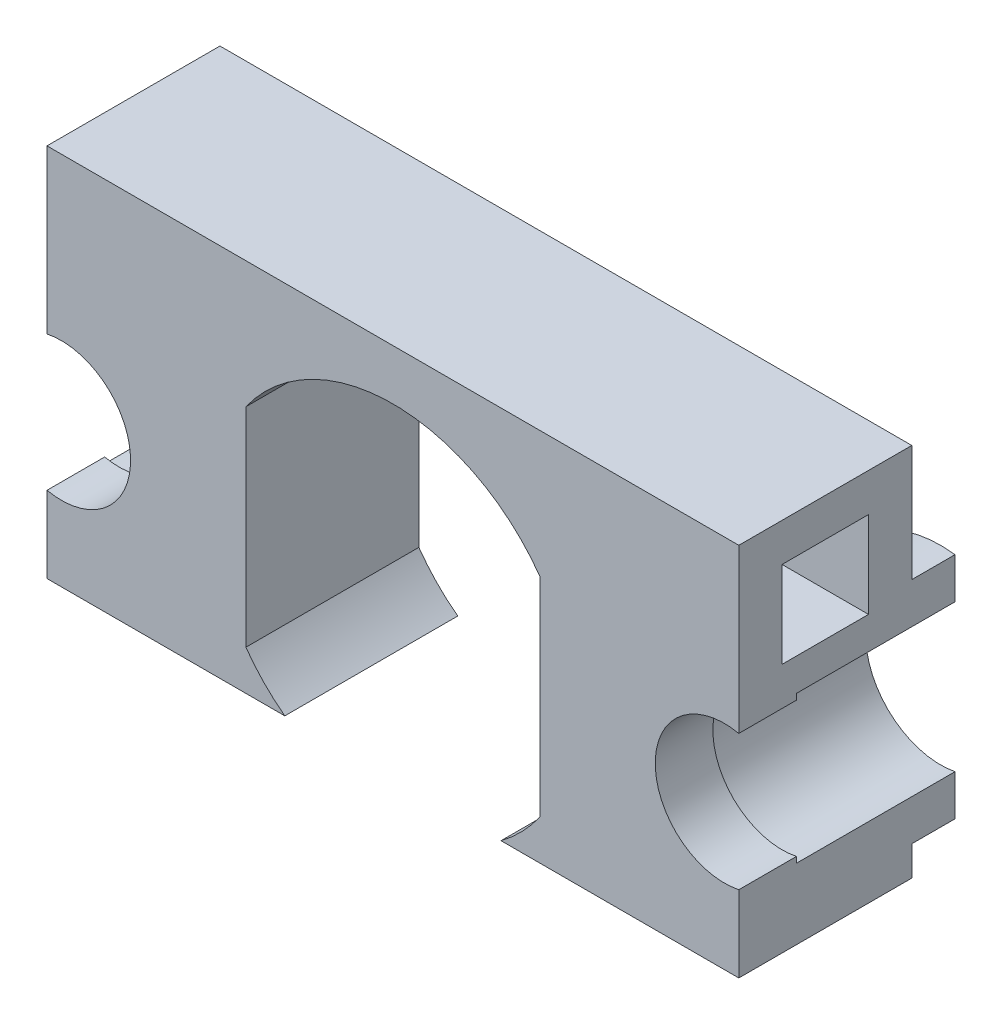
ISO-10303-21;
HEADER;
FILE_DESCRIPTION(('STEP AP214'),'2;1');
FILE_NAME('part.step','',(''),(''),'','','');
FILE_SCHEMA(('AUTOMOTIVE_DESIGN { 1 0 10303 214 1 1 1 1 }'));
ENDSEC;
DATA;
#1=APPLICATION_CONTEXT('core data for automotive mechanical design processes');
#2=APPLICATION_PROTOCOL_DEFINITION('international standard','automotive_design',2000,#1);
#3=PRODUCT_CONTEXT('',#1,'mechanical');
#4=PRODUCT('Part','Part','',(#3));
#5=PRODUCT_RELATED_PRODUCT_CATEGORY('part','',(#4));
#6=PRODUCT_DEFINITION_FORMATION('','',#4);
#7=PRODUCT_DEFINITION_CONTEXT('part definition',#1,'design');
#8=PRODUCT_DEFINITION('design','',#6,#7);
#9=PRODUCT_DEFINITION_SHAPE('','',#8);
#10=(LENGTH_UNIT() NAMED_UNIT(*) SI_UNIT(.MILLI.,.METRE.));
#11=(NAMED_UNIT(*) PLANE_ANGLE_UNIT() SI_UNIT($,.RADIAN.));
#12=(NAMED_UNIT(*) SI_UNIT($,.STERADIAN.) SOLID_ANGLE_UNIT());
#13=UNCERTAINTY_MEASURE_WITH_UNIT(LENGTH_MEASURE(1.E-05),#10,'distance_accuracy_value','');
#14=(GEOMETRIC_REPRESENTATION_CONTEXT(3) GLOBAL_UNCERTAINTY_ASSIGNED_CONTEXT((#13)) GLOBAL_UNIT_ASSIGNED_CONTEXT((#10,
#11,#12)) REPRESENTATION_CONTEXT('',''));
#15=CARTESIAN_POINT('',(0.,0.,0.));
#16=DIRECTION('',(0.,0.,1.));
#17=DIRECTION('',(1.,0.,0.));
#18=AXIS2_PLACEMENT_3D('',#15,#16,#17);
#19=CARTESIAN_POINT('',(-12.,-5.,-7.5));
#20=DIRECTION('',(1.,0.,0.));
#21=DIRECTION('',(0.,0.,-1.));
#22=AXIS2_PLACEMENT_3D('',#19,#20,#21);
#23=PLANE('',#22);
#24=DIRECTION('',(0.,0.,1.));
#25=VECTOR('',#24,1.);
#26=CARTESIAN_POINT('',(-12.,3.96862696659689,-1.5));
#27=LINE('',#26,#25);
#28=CARTESIAN_POINT('',(-12.,3.96862696659689,0.));
#29=VERTEX_POINT('',#28);
#30=CARTESIAN_POINT('',(-12.,3.96862696659689,-1.5));
#31=VERTEX_POINT('',#30);
#32=EDGE_CURVE('E450',#29,#31,#27,.F.);
#33=ORIENTED_EDGE('',*,*,#32,.T.);
#34=DIRECTION('',(0.,1.,0.));
#35=VECTOR('',#34,1.);
#36=CARTESIAN_POINT('',(-12.,0.,-1.5));
#37=LINE('',#36,#35);
#38=CARTESIAN_POINT('',(-12.,2.55147016443461,-1.5));
#39=VERTEX_POINT('',#38);
#40=EDGE_CURVE('E432',#39,#31,#37,.T.);
#41=ORIENTED_EDGE('',*,*,#40,.F.);
#42=DIRECTION('',(0.,0.,-1.));
#43=VECTOR('',#42,1.);
#44=CARTESIAN_POINT('',(-12.,2.55147016443461,6.));
#45=LINE('',#44,#43);
#46=CARTESIAN_POINT('',(-12.,2.55147016443461,4.));
#47=VERTEX_POINT('',#46);
#48=EDGE_CURVE('E56',#39,#47,#45,.F.);
#49=ORIENTED_EDGE('',*,*,#48,.T.);
#50=DIRECTION('',(0.,1.,0.));
#51=VECTOR('',#50,1.);
#52=CARTESIAN_POINT('',(-12.,0.,4.));
#53=LINE('',#52,#51);
#54=CARTESIAN_POINT('',(-12.,2.3473389188611,4.));
#55=VERTEX_POINT('',#54);
#56=EDGE_CURVE('E449',#55,#47,#53,.T.);
#57=ORIENTED_EDGE('',*,*,#56,.F.);
#58=DIRECTION('',(0.,0.,1.));
#59=VECTOR('',#58,1.);
#60=CARTESIAN_POINT('',(-12.,2.3473389188611,4.));
#61=LINE('',#60,#59);
#62=CARTESIAN_POINT('',(-12.,2.3473389188611,6.));
#63=VERTEX_POINT('',#62);
#64=EDGE_CURVE('E339',#63,#55,#61,.F.);
#65=ORIENTED_EDGE('',*,*,#64,.F.);
#66=DIRECTION('',(0.,1.,0.));
#67=VECTOR('',#66,1.);
#68=CARTESIAN_POINT('',(-12.,0.,6.));
#69=LINE('',#68,#67);
#70=CARTESIAN_POINT('',(-12.,8.,6.));
#71=VERTEX_POINT('',#70);
#72=EDGE_CURVE('E12',#63,#71,#69,.T.);
#73=ORIENTED_EDGE('',*,*,#72,.T.);
#74=DIRECTION('',(0.,0.,1.));
#75=VECTOR('',#74,1.);
#76=CARTESIAN_POINT('',(-12.,8.,-7.5));
#77=LINE('',#76,#75);
#78=CARTESIAN_POINT('',(-12.,8.,0.));
#79=VERTEX_POINT('',#78);
#80=EDGE_CURVE('E513',#79,#71,#77,.T.);
#81=ORIENTED_EDGE('',*,*,#80,.F.);
#82=DIRECTION('',(0.,1.,0.));
#83=VECTOR('',#82,1.);
#84=CARTESIAN_POINT('',(-12.,0.,0.));
#85=LINE('',#84,#83);
#86=EDGE_CURVE('E426',#29,#79,#85,.T.);
#87=ORIENTED_EDGE('',*,*,#86,.F.);
#88=EDGE_LOOP('',(#33,#41,#49,#57,#65,#73,#81,#87));
#89=FACE_BOUND('',#88,.T.);
#90=DIRECTION('',(0.,-1.,0.));
#91=VECTOR('',#90,1.);
#92=CARTESIAN_POINT('',(-12.,3.67366945943055,4.5));
#93=LINE('',#92,#91);
#94=CARTESIAN_POINT('',(-12.,6.67366945943055,4.5));
#95=VERTEX_POINT('',#94);
#96=CARTESIAN_POINT('',(-12.,3.67366945943055,4.5));
#97=VERTEX_POINT('',#96);
#98=EDGE_CURVE('E65',#95,#97,#93,.T.);
#99=ORIENTED_EDGE('',*,*,#98,.T.);
#100=DIRECTION('',(0.,0.,-1.));
#101=VECTOR('',#100,1.);
#102=CARTESIAN_POINT('',(-12.,3.67366945943055,1.5));
#103=LINE('',#102,#101);
#104=CARTESIAN_POINT('',(-12.,3.67366945943055,1.5));
#105=VERTEX_POINT('',#104);
#106=EDGE_CURVE('E269',#97,#105,#103,.T.);
#107=ORIENTED_EDGE('',*,*,#106,.T.);
#108=DIRECTION('',(0.,1.,0.));
#109=VECTOR('',#108,1.);
#110=CARTESIAN_POINT('',(-12.,3.67366945943055,1.5));
#111=LINE('',#110,#109);
#112=CARTESIAN_POINT('',(-12.,6.67366945943055,1.5));
#113=VERTEX_POINT('',#112);
#114=EDGE_CURVE('E273',#105,#113,#111,.T.);
#115=ORIENTED_EDGE('',*,*,#114,.T.);
#116=DIRECTION('',(0.,0.,1.));
#117=VECTOR('',#116,1.);
#118=CARTESIAN_POINT('',(-12.,6.67366945943055,1.5));
#119=LINE('',#118,#117);
#120=EDGE_CURVE('E282',#113,#95,#119,.T.);
#121=ORIENTED_EDGE('',*,*,#120,.T.);
#122=EDGE_LOOP('',(#99,#107,#115,#121));
#123=FACE_BOUND('',#122,.T.);
#124=ADVANCED_FACE('F46',(#89,#123),#23,.F.);
#125=CARTESIAN_POINT('',(0.,0.,6.));
#126=DIRECTION('',(0.,0.,-1.));
#127=DIRECTION('',(-1.,0.,0.));
#128=AXIS2_PLACEMENT_3D('',#125,#126,#127);
#129=CYLINDRICAL_SURFACE('',#128,6.25);
#130=CARTESIAN_POINT('',(0.,0.,0.));
#131=DIRECTION('',(0.,0.,1.));
#132=DIRECTION('',(1.,0.,0.));
#133=AXIS2_PLACEMENT_3D('',#130,#131,#132);
#134=CIRCLE('',#133,6.25);
#135=CARTESIAN_POINT('',(-5.1,-3.61282437990003,0.));
#136=VERTEX_POINT('',#135);
#137=CARTESIAN_POINT('',(-3.75,-5.,0.));
#138=VERTEX_POINT('',#137);
#139=EDGE_CURVE('E394',#136,#138,#134,.T.);
#140=ORIENTED_EDGE('',*,*,#139,.F.);
#141=DIRECTION('',(0.,0.,-1.));
#142=VECTOR('',#141,1.);
#143=CARTESIAN_POINT('',(-5.1,-3.61282437990003,6.));
#144=LINE('',#143,#142);
#145=CARTESIAN_POINT('',(-5.1,-3.61282437990003,6.));
#146=VERTEX_POINT('',#145);
#147=EDGE_CURVE('E369',#146,#136,#144,.T.);
#148=ORIENTED_EDGE('',*,*,#147,.F.);
#149=CARTESIAN_POINT('',(0.,0.,6.));
#150=DIRECTION('',(0.,0.,1.));
#151=DIRECTION('',(1.,0.,0.));
#152=AXIS2_PLACEMENT_3D('',#149,#150,#151);
#153=CIRCLE('',#152,6.25);
#154=CARTESIAN_POINT('',(-3.75,-5.,6.));
#155=VERTEX_POINT('',#154);
#156=EDGE_CURVE('E330',#146,#155,#153,.T.);
#157=ORIENTED_EDGE('',*,*,#156,.T.);
#158=DIRECTION('',(0.,0.,-1.));
#159=VECTOR('',#158,1.);
#160=CARTESIAN_POINT('',(-3.75,-5.,6.));
#161=LINE('',#160,#159);
#162=EDGE_CURVE('E364',#155,#138,#161,.T.);
#163=ORIENTED_EDGE('',*,*,#162,.T.);
#164=EDGE_LOOP('',(#140,#148,#157,#163));
#165=FACE_BOUND('',#164,.T.);
#166=ADVANCED_FACE('F608',(#165),#129,.F.);
#167=CARTESIAN_POINT('',(-5.1,0.,6.));
#168=DIRECTION('',(-1.,0.,0.));
#169=DIRECTION('',(0.,-1.,0.));
#170=AXIS2_PLACEMENT_3D('',#167,#168,#169);
#171=PLANE('',#170);
#172=DIRECTION('',(0.,1.,0.));
#173=VECTOR('',#172,1.);
#174=CARTESIAN_POINT('',(-5.1,0.,0.));
#175=LINE('',#174,#173);
#176=CARTESIAN_POINT('',(-5.1,3.61282437990003,0.));
#177=VERTEX_POINT('',#176);
#178=EDGE_CURVE('E368',#136,#177,#175,.T.);
#179=ORIENTED_EDGE('',*,*,#178,.T.);
#180=DIRECTION('',(0.,0.,-1.));
#181=VECTOR('',#180,1.);
#182=CARTESIAN_POINT('',(-5.1,3.61282437990003,6.));
#183=LINE('',#182,#181);
#184=CARTESIAN_POINT('',(-5.1,3.61282437990003,6.));
#185=VERTEX_POINT('',#184);
#186=EDGE_CURVE('E373',#185,#177,#183,.T.);
#187=ORIENTED_EDGE('',*,*,#186,.F.);
#188=DIRECTION('',(0.,1.,0.));
#189=VECTOR('',#188,1.);
#190=CARTESIAN_POINT('',(-5.1,0.,6.));
#191=LINE('',#190,#189);
#192=EDGE_CURVE('E411',#146,#185,#191,.T.);
#193=ORIENTED_EDGE('',*,*,#192,.F.);
#194=ORIENTED_EDGE('',*,*,#147,.T.);
#195=EDGE_LOOP('',(#179,#187,#193,#194));
#196=FACE_BOUND('',#195,.T.);
#197=ADVANCED_FACE('F615',(#196),#171,.F.);
#198=CARTESIAN_POINT('',(0.,0.,6.));
#199=DIRECTION('',(0.,0.,-1.));
#200=DIRECTION('',(-1.,0.,0.));
#201=AXIS2_PLACEMENT_3D('',#198,#199,#200);
#202=CYLINDRICAL_SURFACE('',#201,6.25);
#203=CARTESIAN_POINT('',(0.,0.,0.));
#204=DIRECTION('',(0.,0.,1.));
#205=DIRECTION('',(1.,0.,0.));
#206=AXIS2_PLACEMENT_3D('',#203,#204,#205);
#207=CIRCLE('',#206,6.25);
#208=CARTESIAN_POINT('',(5.1,3.61282437990003,0.));
#209=VERTEX_POINT('',#208);
#210=EDGE_CURVE('E389',#209,#177,#207,.T.);
#211=ORIENTED_EDGE('',*,*,#210,.F.);
#212=DIRECTION('',(0.,0.,-1.));
#213=VECTOR('',#212,1.);
#214=CARTESIAN_POINT('',(5.1,3.61282437990003,6.));
#215=LINE('',#214,#213);
#216=CARTESIAN_POINT('',(5.1,3.61282437990003,6.));
#217=VERTEX_POINT('',#216);
#218=EDGE_CURVE('E377',#217,#209,#215,.T.);
#219=ORIENTED_EDGE('',*,*,#218,.F.);
#220=CARTESIAN_POINT('',(0.,0.,6.));
#221=DIRECTION('',(0.,0.,1.));
#222=DIRECTION('',(1.,0.,0.));
#223=AXIS2_PLACEMENT_3D('',#220,#221,#222);
#224=CIRCLE('',#223,6.25);
#225=EDGE_CURVE('E372',#217,#185,#224,.T.);
#226=ORIENTED_EDGE('',*,*,#225,.T.);
#227=ORIENTED_EDGE('',*,*,#186,.T.);
#228=EDGE_LOOP('',(#211,#219,#226,#227));
#229=FACE_BOUND('',#228,.T.);
#230=ADVANCED_FACE('F618',(#229),#202,.F.);
#231=CARTESIAN_POINT('',(5.1,0.,6.));
#232=DIRECTION('',(-1.,0.,0.));
#233=DIRECTION('',(0.,0.,1.));
#234=AXIS2_PLACEMENT_3D('',#231,#232,#233);
#235=PLANE('',#234);
#236=DIRECTION('',(0.,1.,0.));
#237=VECTOR('',#236,1.);
#238=CARTESIAN_POINT('',(5.1,0.,0.));
#239=LINE('',#238,#237);
#240=CARTESIAN_POINT('',(5.1,-3.61282437990002,0.));
#241=VERTEX_POINT('',#240);
#242=EDGE_CURVE('E385',#241,#209,#239,.T.);
#243=ORIENTED_EDGE('',*,*,#242,.F.);
#244=DIRECTION('',(0.,0.,-1.));
#245=VECTOR('',#244,1.);
#246=CARTESIAN_POINT('',(5.1,-3.61282437990002,6.));
#247=LINE('',#246,#245);
#248=CARTESIAN_POINT('',(5.1,-3.61282437990002,6.));
#249=VERTEX_POINT('',#248);
#250=EDGE_CURVE('E381',#249,#241,#247,.T.);
#251=ORIENTED_EDGE('',*,*,#250,.F.);
#252=DIRECTION('',(0.,1.,0.));
#253=VECTOR('',#252,1.);
#254=CARTESIAN_POINT('',(5.1,0.,6.));
#255=LINE('',#254,#253);
#256=EDGE_CURVE('E376',#249,#217,#255,.T.);
#257=ORIENTED_EDGE('',*,*,#256,.T.);
#258=ORIENTED_EDGE('',*,*,#218,.T.);
#259=EDGE_LOOP('',(#243,#251,#257,#258));
#260=FACE_BOUND('',#259,.T.);
#261=ADVANCED_FACE('F621',(#260),#235,.T.);
#262=CARTESIAN_POINT('',(0.,0.,6.));
#263=DIRECTION('',(0.,0.,-1.));
#264=DIRECTION('',(-1.,0.,0.));
#265=AXIS2_PLACEMENT_3D('',#262,#263,#264);
#266=CYLINDRICAL_SURFACE('',#265,6.25);
#267=CARTESIAN_POINT('',(0.,0.,0.));
#268=DIRECTION('',(0.,0.,1.));
#269=DIRECTION('',(1.,0.,0.));
#270=AXIS2_PLACEMENT_3D('',#267,#268,#269);
#271=CIRCLE('',#270,6.25);
#272=CARTESIAN_POINT('',(3.75,-5.,0.));
#273=VERTEX_POINT('',#272);
#274=EDGE_CURVE('E390',#273,#241,#271,.T.);
#275=ORIENTED_EDGE('',*,*,#274,.F.);
#276=DIRECTION('',(0.,0.,-1.));
#277=VECTOR('',#276,1.);
#278=CARTESIAN_POINT('',(3.75,-5.,6.));
#279=LINE('',#278,#277);
#280=CARTESIAN_POINT('',(3.75,-5.,6.));
#281=VERTEX_POINT('',#280);
#282=EDGE_CURVE('E359',#281,#273,#279,.T.);
#283=ORIENTED_EDGE('',*,*,#282,.F.);
#284=CARTESIAN_POINT('',(0.,0.,6.));
#285=DIRECTION('',(0.,0.,1.));
#286=DIRECTION('',(1.,0.,0.));
#287=AXIS2_PLACEMENT_3D('',#284,#285,#286);
#288=CIRCLE('',#287,6.25);
#289=EDGE_CURVE('E380',#281,#249,#288,.T.);
#290=ORIENTED_EDGE('',*,*,#289,.T.);
#291=ORIENTED_EDGE('',*,*,#250,.T.);
#292=EDGE_LOOP('',(#275,#283,#290,#291));
#293=FACE_BOUND('',#292,.T.);
#294=ADVANCED_FACE('F627',(#293),#266,.F.);
#295=CARTESIAN_POINT('',(11.5,0.,-1.5));
#296=DIRECTION('',(0.,0.,1.));
#297=DIRECTION('',(1.,0.,0.));
#298=AXIS2_PLACEMENT_3D('',#295,#296,#297);
#299=PLANE('',#298);
#300=CARTESIAN_POINT('',(11.5,0.,-1.5));
#301=DIRECTION('',(0.,0.,1.));
#302=DIRECTION('',(1.,0.,0.));
#303=AXIS2_PLACEMENT_3D('',#300,#301,#302);
#304=CIRCLE('',#303,4.);
#305=CARTESIAN_POINT('',(12.,3.96862696659689,-1.5));
#306=VERTEX_POINT('',#305);
#307=CARTESIAN_POINT('',(12.,-3.96862696659688,-1.5));
#308=VERTEX_POINT('',#307);
#309=EDGE_CURVE('E465',#306,#308,#304,.T.);
#310=ORIENTED_EDGE('',*,*,#309,.F.);
#311=DIRECTION('',(0.,-1.,0.));
#312=VECTOR('',#311,1.);
#313=CARTESIAN_POINT('',(12.,0.,-1.5));
#314=LINE('',#313,#312);
#315=CARTESIAN_POINT('',(12.,2.55147016443462,-1.5));
#316=VERTEX_POINT('',#315);
#317=EDGE_CURVE('E384',#306,#316,#314,.T.);
#318=ORIENTED_EDGE('',*,*,#317,.T.);
#319=CARTESIAN_POINT('',(11.5,0.,-1.5));
#320=DIRECTION('',(0.,0.,1.));
#321=DIRECTION('',(1.,0.,0.));
#322=AXIS2_PLACEMENT_3D('',#319,#320,#321);
#323=CIRCLE('',#322,2.6);
#324=CARTESIAN_POINT('',(12.,-2.55147016443461,-1.5));
#325=VERTEX_POINT('',#324);
#326=EDGE_CURVE('E492',#316,#325,#323,.T.);
#327=ORIENTED_EDGE('',*,*,#326,.T.);
#328=EDGE_CURVE('E493',#325,#308,#314,.T.);
#329=ORIENTED_EDGE('',*,*,#328,.T.);
#330=EDGE_LOOP('',(#310,#318,#327,#329));
#331=FACE_BOUND('',#330,.T.);
#332=ADVANCED_FACE('F569',(#331),#299,.F.);
#333=CARTESIAN_POINT('',(11.5,0.,-1.5));
#334=DIRECTION('',(0.,0.,1.));
#335=DIRECTION('',(1.,0.,0.));
#336=AXIS2_PLACEMENT_3D('',#333,#334,#335);
#337=CYLINDRICAL_SURFACE('',#336,4.);
#338=DIRECTION('',(0.,0.,1.));
#339=VECTOR('',#338,1.);
#340=CARTESIAN_POINT('',(12.,-3.96862696659688,-1.5));
#341=LINE('',#340,#339);
#342=CARTESIAN_POINT('',(12.,-3.96862696659688,0.));
#343=VERTEX_POINT('',#342);
#344=EDGE_CURVE('E473',#343,#308,#341,.F.);
#345=ORIENTED_EDGE('',*,*,#344,.F.);
#346=CARTESIAN_POINT('',(11.5,0.,0.));
#347=DIRECTION('',(0.,0.,1.));
#348=DIRECTION('',(1.,0.,0.));
#349=AXIS2_PLACEMENT_3D('',#346,#347,#348);
#350=CIRCLE('',#349,4.);
#351=CARTESIAN_POINT('',(12.,3.96862696659689,0.));
#352=VERTEX_POINT('',#351);
#353=EDGE_CURVE('E485',#352,#343,#350,.T.);
#354=ORIENTED_EDGE('',*,*,#353,.F.);
#355=DIRECTION('',(0.,0.,1.));
#356=VECTOR('',#355,1.);
#357=CARTESIAN_POINT('',(12.,3.96862696659689,-1.5));
#358=LINE('',#357,#356);
#359=EDGE_CURVE('E477',#306,#352,#358,.T.);
#360=ORIENTED_EDGE('',*,*,#359,.F.);
#361=ORIENTED_EDGE('',*,*,#309,.T.);
#362=EDGE_LOOP('',(#345,#354,#360,#361));
#363=FACE_BOUND('',#362,.T.);
#364=ADVANCED_FACE('F573',(#363),#337,.T.);
#365=CARTESIAN_POINT('',(-11.5,0.,-1.5));
#366=DIRECTION('',(0.,0.,1.));
#367=DIRECTION('',(1.,0.,0.));
#368=AXIS2_PLACEMENT_3D('',#365,#366,#367);
#369=PLANE('',#368);
#370=CARTESIAN_POINT('',(-11.5,0.,-1.5));
#371=DIRECTION('',(0.,0.,1.));
#372=DIRECTION('',(1.,0.,0.));
#373=AXIS2_PLACEMENT_3D('',#370,#371,#372);
#374=CIRCLE('',#373,4.);
#375=CARTESIAN_POINT('',(-12.,-3.96862696659689,-1.5));
#376=VERTEX_POINT('',#375);
#377=EDGE_CURVE('E428',#376,#31,#374,.T.);
#378=ORIENTED_EDGE('',*,*,#377,.F.);
#379=CARTESIAN_POINT('',(-12.,-2.55147016443461,-1.5));
#380=VERTEX_POINT('',#379);
#381=EDGE_CURVE('E437',#376,#380,#37,.T.);
#382=ORIENTED_EDGE('',*,*,#381,.T.);
#383=CARTESIAN_POINT('',(-11.5,0.,-1.5));
#384=DIRECTION('',(0.,0.,1.));
#385=DIRECTION('',(1.,0.,0.));
#386=AXIS2_PLACEMENT_3D('',#383,#384,#385);
#387=CIRCLE('',#386,2.6);
#388=EDGE_CURVE('E433',#380,#39,#387,.T.);
#389=ORIENTED_EDGE('',*,*,#388,.T.);
#390=ORIENTED_EDGE('',*,*,#40,.T.);
#391=EDGE_LOOP('',(#378,#382,#389,#390));
#392=FACE_BOUND('',#391,.T.);
#393=ADVANCED_FACE('F591',(#392),#369,.F.);
#394=CARTESIAN_POINT('',(-11.5,0.,-1.5));
#395=DIRECTION('',(0.,0.,1.));
#396=DIRECTION('',(1.,0.,0.));
#397=AXIS2_PLACEMENT_3D('',#394,#395,#396);
#398=CYLINDRICAL_SURFACE('',#397,4.);
#399=ORIENTED_EDGE('',*,*,#32,.F.);
#400=CARTESIAN_POINT('',(-11.5,0.,0.));
#401=DIRECTION('',(0.,0.,1.));
#402=DIRECTION('',(1.,0.,0.));
#403=AXIS2_PLACEMENT_3D('',#400,#401,#402);
#404=CIRCLE('',#403,4.);
#405=CARTESIAN_POINT('',(-12.,-3.96862696659689,0.));
#406=VERTEX_POINT('',#405);
#407=EDGE_CURVE('E422',#406,#29,#404,.T.);
#408=ORIENTED_EDGE('',*,*,#407,.F.);
#409=DIRECTION('',(0.,0.,1.));
#410=VECTOR('',#409,1.);
#411=CARTESIAN_POINT('',(-12.,-3.96862696659689,-1.5));
#412=LINE('',#411,#410);
#413=EDGE_CURVE('E453',#376,#406,#412,.T.);
#414=ORIENTED_EDGE('',*,*,#413,.F.);
#415=ORIENTED_EDGE('',*,*,#377,.T.);
#416=EDGE_LOOP('',(#399,#408,#414,#415));
#417=FACE_BOUND('',#416,.T.);
#418=ADVANCED_FACE('F598',(#417),#398,.T.);
#419=CARTESIAN_POINT('',(0.,0.,0.));
#420=DIRECTION('',(0.,0.,1.));
#421=DIRECTION('',(1.,0.,0.));
#422=AXIS2_PLACEMENT_3D('',#419,#420,#421);
#423=PLANE('',#422);
#424=DIRECTION('',(1.,0.,0.));
#425=VECTOR('',#424,1.);
#426=CARTESIAN_POINT('',(0.,-5.,0.));
#427=LINE('',#426,#425);
#428=CARTESIAN_POINT('',(-12.,-5.,0.));
#429=VERTEX_POINT('',#428);
#430=EDGE_CURVE('E518',#429,#138,#427,.T.);
#431=ORIENTED_EDGE('',*,*,#430,.F.);
#432=EDGE_CURVE('E427',#429,#406,#85,.T.);
#433=ORIENTED_EDGE('',*,*,#432,.T.);
#434=ORIENTED_EDGE('',*,*,#407,.T.);
#435=ORIENTED_EDGE('',*,*,#86,.T.);
#436=DIRECTION('',(1.,0.,0.));
#437=VECTOR('',#436,1.);
#438=CARTESIAN_POINT('',(0.,8.,0.));
#439=LINE('',#438,#437);
#440=CARTESIAN_POINT('',(12.,8.,0.));
#441=VERTEX_POINT('',#440);
#442=EDGE_CURVE('E50',#79,#441,#439,.T.);
#443=ORIENTED_EDGE('',*,*,#442,.T.);
#444=DIRECTION('',(0.,-1.,0.));
#445=VECTOR('',#444,1.);
#446=CARTESIAN_POINT('',(12.,0.,0.));
#447=LINE('',#446,#445);
#448=EDGE_CURVE('E481',#441,#352,#447,.T.);
#449=ORIENTED_EDGE('',*,*,#448,.T.);
#450=ORIENTED_EDGE('',*,*,#353,.T.);
#451=CARTESIAN_POINT('',(12.,-5.,0.));
#452=VERTEX_POINT('',#451);
#453=EDGE_CURVE('E404',#343,#452,#447,.T.);
#454=ORIENTED_EDGE('',*,*,#453,.T.);
#455=DIRECTION('',(1.,0.,0.));
#456=VECTOR('',#455,1.);
#457=CARTESIAN_POINT('',(0.,-5.,0.));
#458=LINE('',#457,#456);
#459=EDGE_CURVE('E510',#273,#452,#458,.T.);
#460=ORIENTED_EDGE('',*,*,#459,.F.);
#461=ORIENTED_EDGE('',*,*,#274,.T.);
#462=ORIENTED_EDGE('',*,*,#242,.T.);
#463=ORIENTED_EDGE('',*,*,#210,.T.);
#464=ORIENTED_EDGE('',*,*,#178,.F.);
#465=ORIENTED_EDGE('',*,*,#139,.T.);
#466=EDGE_LOOP('',(#431,#433,#434,#435,#443,#449,#450,#454,#460,#461,#462,#463,#464,#465));
#467=FACE_BOUND('',#466,.T.);
#468=ADVANCED_FACE('F579',(#467),#423,.F.);
#469=CARTESIAN_POINT('',(-11.5,0.,4.));
#470=DIRECTION('',(0.,0.,1.));
#471=DIRECTION('',(1.,0.,0.));
#472=AXIS2_PLACEMENT_3D('',#469,#470,#471);
#473=CYLINDRICAL_SURFACE('',#472,2.4);
#474=CARTESIAN_POINT('',(-11.5,0.,6.));
#475=DIRECTION('',(0.,0.,1.));
#476=DIRECTION('',(1.,0.,0.));
#477=AXIS2_PLACEMENT_3D('',#474,#475,#476);
#478=CIRCLE('',#477,2.4);
#479=CARTESIAN_POINT('',(-12.,-2.3473389188611,6.));
#480=VERTEX_POINT('',#479);
#481=EDGE_CURVE('E344',#480,#63,#478,.T.);
#482=ORIENTED_EDGE('',*,*,#481,.T.);
#483=ORIENTED_EDGE('',*,*,#64,.T.);
#484=CARTESIAN_POINT('',(-11.5,0.,4.));
#485=DIRECTION('',(0.,0.,1.));
#486=DIRECTION('',(1.,0.,0.));
#487=AXIS2_PLACEMENT_3D('',#484,#485,#486);
#488=CIRCLE('',#487,2.4);
#489=CARTESIAN_POINT('',(-12.,-2.3473389188611,4.));
#490=VERTEX_POINT('',#489);
#491=EDGE_CURVE('E445',#490,#55,#488,.T.);
#492=ORIENTED_EDGE('',*,*,#491,.F.);
#493=DIRECTION('',(0.,0.,1.));
#494=VECTOR('',#493,1.);
#495=CARTESIAN_POINT('',(-12.,-2.3473389188611,4.));
#496=LINE('',#495,#494);
#497=EDGE_CURVE('E343',#490,#480,#496,.T.);
#498=ORIENTED_EDGE('',*,*,#497,.T.);
#499=EDGE_LOOP('',(#482,#483,#492,#498));
#500=FACE_BOUND('',#499,.T.);
#501=ADVANCED_FACE('F643',(#500),#473,.F.);
#502=CARTESIAN_POINT('',(-11.5,0.,4.));
#503=DIRECTION('',(0.,0.,1.));
#504=DIRECTION('',(1.,0.,0.));
#505=AXIS2_PLACEMENT_3D('',#502,#503,#504);
#506=PLANE('',#505);
#507=CARTESIAN_POINT('',(-11.5,0.,4.));
#508=DIRECTION('',(0.,0.,1.));
#509=DIRECTION('',(1.,0.,0.));
#510=AXIS2_PLACEMENT_3D('',#507,#508,#509);
#511=CIRCLE('',#510,2.6);
#512=CARTESIAN_POINT('',(-12.,-2.55147016443461,4.));
#513=VERTEX_POINT('',#512);
#514=EDGE_CURVE('E362',#513,#47,#511,.T.);
#515=ORIENTED_EDGE('',*,*,#514,.F.);
#516=EDGE_CURVE('E348',#513,#490,#53,.T.);
#517=ORIENTED_EDGE('',*,*,#516,.T.);
#518=ORIENTED_EDGE('',*,*,#491,.T.);
#519=ORIENTED_EDGE('',*,*,#56,.T.);
#520=EDGE_LOOP('',(#515,#517,#518,#519));
#521=FACE_BOUND('',#520,.T.);
#522=ADVANCED_FACE('F637',(#521),#506,.F.);
#523=CARTESIAN_POINT('',(11.5,0.,4.));
#524=DIRECTION('',(0.,0.,1.));
#525=DIRECTION('',(1.,0.,0.));
#526=AXIS2_PLACEMENT_3D('',#523,#524,#525);
#527=CYLINDRICAL_SURFACE('',#526,2.4);
#528=CARTESIAN_POINT('',(11.5,0.,6.));
#529=DIRECTION('',(0.,0.,1.));
#530=DIRECTION('',(1.,0.,0.));
#531=AXIS2_PLACEMENT_3D('',#528,#529,#530);
#532=CIRCLE('',#531,2.4);
#533=CARTESIAN_POINT('',(12.,2.3473389188611,6.));
#534=VERTEX_POINT('',#533);
#535=CARTESIAN_POINT('',(12.,-2.34733891886109,6.));
#536=VERTEX_POINT('',#535);
#537=EDGE_CURVE('E354',#534,#536,#532,.T.);
#538=ORIENTED_EDGE('',*,*,#537,.T.);
#539=DIRECTION('',(0.,0.,1.));
#540=VECTOR('',#539,1.);
#541=CARTESIAN_POINT('',(12.,-2.34733891886109,4.));
#542=LINE('',#541,#540);
#543=CARTESIAN_POINT('',(12.,-2.34733891886109,4.));
#544=VERTEX_POINT('',#543);
#545=EDGE_CURVE('E349',#536,#544,#542,.F.);
#546=ORIENTED_EDGE('',*,*,#545,.T.);
#547=CARTESIAN_POINT('',(11.5,0.,4.));
#548=DIRECTION('',(0.,0.,1.));
#549=DIRECTION('',(1.,0.,0.));
#550=AXIS2_PLACEMENT_3D('',#547,#548,#549);
#551=CIRCLE('',#550,2.4);
#552=CARTESIAN_POINT('',(12.,2.3473389188611,4.));
#553=VERTEX_POINT('',#552);
#554=EDGE_CURVE('E503',#553,#544,#551,.T.);
#555=ORIENTED_EDGE('',*,*,#554,.F.);
#556=DIRECTION('',(0.,0.,1.));
#557=VECTOR('',#556,1.);
#558=CARTESIAN_POINT('',(12.,2.3473389188611,4.));
#559=LINE('',#558,#557);
#560=EDGE_CURVE('E353',#553,#534,#559,.T.);
#561=ORIENTED_EDGE('',*,*,#560,.T.);
#562=EDGE_LOOP('',(#538,#546,#555,#561));
#563=FACE_BOUND('',#562,.T.);
#564=ADVANCED_FACE('F652',(#563),#527,.F.);
#565=CARTESIAN_POINT('',(11.5,0.,4.));
#566=DIRECTION('',(0.,0.,1.));
#567=DIRECTION('',(1.,0.,0.));
#568=AXIS2_PLACEMENT_3D('',#565,#566,#567);
#569=PLANE('',#568);
#570=CARTESIAN_POINT('',(11.5,0.,4.));
#571=DIRECTION('',(0.,0.,1.));
#572=DIRECTION('',(1.,0.,0.));
#573=AXIS2_PLACEMENT_3D('',#570,#571,#572);
#574=CIRCLE('',#573,2.6);
#575=CARTESIAN_POINT('',(12.,2.55147016443462,4.));
#576=VERTEX_POINT('',#575);
#577=CARTESIAN_POINT('',(12.,-2.55147016443461,4.));
#578=VERTEX_POINT('',#577);
#579=EDGE_CURVE('E441',#576,#578,#574,.T.);
#580=ORIENTED_EDGE('',*,*,#579,.F.);
#581=DIRECTION('',(0.,-1.,0.));
#582=VECTOR('',#581,1.);
#583=CARTESIAN_POINT('',(12.,0.,4.));
#584=LINE('',#583,#582);
#585=EDGE_CURVE('E358',#576,#553,#584,.T.);
#586=ORIENTED_EDGE('',*,*,#585,.T.);
#587=ORIENTED_EDGE('',*,*,#554,.T.);
#588=EDGE_CURVE('E504',#544,#578,#584,.T.);
#589=ORIENTED_EDGE('',*,*,#588,.T.);
#590=EDGE_LOOP('',(#580,#586,#587,#589));
#591=FACE_BOUND('',#590,.T.);
#592=ADVANCED_FACE('F557',(#591),#569,.F.);
#593=CARTESIAN_POINT('',(0.,0.,6.));
#594=DIRECTION('',(0.,0.,1.));
#595=DIRECTION('',(1.,0.,0.));
#596=AXIS2_PLACEMENT_3D('',#593,#594,#595);
#597=PLANE('',#596);
#598=CARTESIAN_POINT('',(-12.,-5.,6.));
#599=VERTEX_POINT('',#598);
#600=EDGE_CURVE('E58',#599,#480,#69,.T.);
#601=ORIENTED_EDGE('',*,*,#600,.F.);
#602=DIRECTION('',(1.,0.,0.));
#603=VECTOR('',#602,1.);
#604=CARTESIAN_POINT('',(0.,-5.,6.));
#605=LINE('',#604,#603);
#606=EDGE_CURVE('E415',#599,#155,#605,.T.);
#607=ORIENTED_EDGE('',*,*,#606,.T.);
#608=ORIENTED_EDGE('',*,*,#156,.F.);
#609=ORIENTED_EDGE('',*,*,#192,.T.);
#610=ORIENTED_EDGE('',*,*,#225,.F.);
#611=ORIENTED_EDGE('',*,*,#256,.F.);
#612=ORIENTED_EDGE('',*,*,#289,.F.);
#613=DIRECTION('',(1.,0.,0.));
#614=VECTOR('',#613,1.);
#615=CARTESIAN_POINT('',(0.,-5.,6.));
#616=LINE('',#615,#614);
#617=CARTESIAN_POINT('',(12.,-5.,6.));
#618=VERTEX_POINT('',#617);
#619=EDGE_CURVE('E414',#281,#618,#616,.T.);
#620=ORIENTED_EDGE('',*,*,#619,.T.);
#621=DIRECTION('',(0.,-1.,0.));
#622=VECTOR('',#621,1.);
#623=CARTESIAN_POINT('',(12.,0.,6.));
#624=LINE('',#623,#622);
#625=EDGE_CURVE('E480',#536,#618,#624,.T.);
#626=ORIENTED_EDGE('',*,*,#625,.F.);
#627=ORIENTED_EDGE('',*,*,#537,.F.);
#628=CARTESIAN_POINT('',(12.,8.,6.));
#629=VERTEX_POINT('',#628);
#630=EDGE_CURVE('E496',#629,#534,#624,.T.);
#631=ORIENTED_EDGE('',*,*,#630,.F.);
#632=DIRECTION('',(1.,0.,0.));
#633=VECTOR('',#632,1.);
#634=CARTESIAN_POINT('',(0.,8.,6.));
#635=LINE('',#634,#633);
#636=EDGE_CURVE('E517',#71,#629,#635,.T.);
#637=ORIENTED_EDGE('',*,*,#636,.F.);
#638=ORIENTED_EDGE('',*,*,#72,.F.);
#639=ORIENTED_EDGE('',*,*,#481,.F.);
#640=EDGE_LOOP('',(#601,#607,#608,#609,#610,#611,#612,#620,#626,#627,#631,#637,#638,#639));
#641=FACE_BOUND('',#640,.T.);
#642=ADVANCED_FACE('F610',(#641),#597,.T.);
#643=CARTESIAN_POINT('',(0.,-5.,6.));
#644=DIRECTION('',(0.,1.,0.));
#645=DIRECTION('',(-1.,0.,0.));
#646=AXIS2_PLACEMENT_3D('',#643,#644,#645);
#647=PLANE('',#646);
#648=ORIENTED_EDGE('',*,*,#606,.F.);
#649=DIRECTION('',(0.,0.,1.));
#650=VECTOR('',#649,1.);
#651=CARTESIAN_POINT('',(-12.,-5.,-7.5));
#652=LINE('',#651,#650);
#653=EDGE_CURVE('E469',#429,#599,#652,.T.);
#654=ORIENTED_EDGE('',*,*,#653,.F.);
#655=ORIENTED_EDGE('',*,*,#430,.T.);
#656=ORIENTED_EDGE('',*,*,#162,.F.);
#657=EDGE_LOOP('',(#648,#654,#655,#656));
#658=FACE_BOUND('',#657,.T.);
#659=ADVANCED_FACE('F606',(#658),#647,.F.);
#660=CARTESIAN_POINT('',(0.,8.,6.));
#661=DIRECTION('',(0.,1.,0.));
#662=DIRECTION('',(0.,0.,1.));
#663=AXIS2_PLACEMENT_3D('',#660,#661,#662);
#664=PLANE('',#663);
#665=ORIENTED_EDGE('',*,*,#80,.T.);
#666=ORIENTED_EDGE('',*,*,#636,.T.);
#667=DIRECTION('',(0.,0.,1.));
#668=VECTOR('',#667,1.);
#669=CARTESIAN_POINT('',(12.,8.,-7.5));
#670=LINE('',#669,#668);
#671=EDGE_CURVE('E499',#441,#629,#670,.T.);
#672=ORIENTED_EDGE('',*,*,#671,.F.);
#673=ORIENTED_EDGE('',*,*,#442,.F.);
#674=EDGE_LOOP('',(#665,#666,#672,#673));
#675=FACE_BOUND('',#674,.T.);
#676=ADVANCED_FACE('F650',(#675),#664,.T.);
#677=CARTESIAN_POINT('',(0.,-5.,6.));
#678=DIRECTION('',(0.,1.,0.));
#679=DIRECTION('',(-1.,0.,0.));
#680=AXIS2_PLACEMENT_3D('',#677,#678,#679);
#681=PLANE('',#680);
#682=ORIENTED_EDGE('',*,*,#459,.T.);
#683=DIRECTION('',(0.,0.,1.));
#684=VECTOR('',#683,1.);
#685=CARTESIAN_POINT('',(12.,-5.,-7.5));
#686=LINE('',#685,#684);
#687=EDGE_CURVE('E363',#452,#618,#686,.T.);
#688=ORIENTED_EDGE('',*,*,#687,.T.);
#689=ORIENTED_EDGE('',*,*,#619,.F.);
#690=ORIENTED_EDGE('',*,*,#282,.T.);
#691=EDGE_LOOP('',(#682,#688,#689,#690));
#692=FACE_BOUND('',#691,.T.);
#693=ADVANCED_FACE('F630',(#692),#681,.F.);
#694=CARTESIAN_POINT('',(-11.5,0.,6.));
#695=DIRECTION('',(0.,0.,-1.));
#696=DIRECTION('',(-1.,0.,0.));
#697=AXIS2_PLACEMENT_3D('',#694,#695,#696);
#698=CYLINDRICAL_SURFACE('',#697,2.6);
#699=DIRECTION('',(0.,0.,-1.));
#700=VECTOR('',#699,1.);
#701=CARTESIAN_POINT('',(-12.,-2.55147016443461,6.));
#702=LINE('',#701,#700);
#703=EDGE_CURVE('E461',#513,#380,#702,.T.);
#704=ORIENTED_EDGE('',*,*,#703,.F.);
#705=ORIENTED_EDGE('',*,*,#514,.T.);
#706=ORIENTED_EDGE('',*,*,#48,.F.);
#707=ORIENTED_EDGE('',*,*,#388,.F.);
#708=EDGE_LOOP('',(#704,#705,#706,#707));
#709=FACE_BOUND('',#708,.T.);
#710=ADVANCED_FACE('F641',(#709),#698,.F.);
#711=CARTESIAN_POINT('',(11.5,0.,6.));
#712=DIRECTION('',(0.,0.,-1.));
#713=DIRECTION('',(-1.,0.,0.));
#714=AXIS2_PLACEMENT_3D('',#711,#712,#713);
#715=CYLINDRICAL_SURFACE('',#714,2.6);
#716=DIRECTION('',(0.,0.,-1.));
#717=VECTOR('',#716,1.);
#718=CARTESIAN_POINT('',(12.,2.55147016443462,6.));
#719=LINE('',#718,#717);
#720=EDGE_CURVE('E488',#576,#316,#719,.T.);
#721=ORIENTED_EDGE('',*,*,#720,.F.);
#722=ORIENTED_EDGE('',*,*,#579,.T.);
#723=DIRECTION('',(0.,0.,-1.));
#724=VECTOR('',#723,1.);
#725=CARTESIAN_POINT('',(12.,-2.55147016443461,6.));
#726=LINE('',#725,#724);
#727=EDGE_CURVE('E476',#325,#578,#726,.F.);
#728=ORIENTED_EDGE('',*,*,#727,.F.);
#729=ORIENTED_EDGE('',*,*,#326,.F.);
#730=EDGE_LOOP('',(#721,#722,#728,#729));
#731=FACE_BOUND('',#730,.T.);
#732=ADVANCED_FACE('F48',(#731),#715,.F.);
#733=CARTESIAN_POINT('',(12.,-5.,-7.5));
#734=DIRECTION('',(-1.,0.,0.));
#735=DIRECTION('',(0.,0.,1.));
#736=AXIS2_PLACEMENT_3D('',#733,#734,#735);
#737=PLANE('',#736);
#738=DIRECTION('',(0.,0.,-1.));
#739=VECTOR('',#738,1.);
#740=CARTESIAN_POINT('',(12.,3.67366945943055,1.5));
#741=LINE('',#740,#739);
#742=CARTESIAN_POINT('',(12.,3.67366945943055,4.5));
#743=VERTEX_POINT('',#742);
#744=CARTESIAN_POINT('',(12.,3.67366945943055,1.5));
#745=VERTEX_POINT('',#744);
#746=EDGE_CURVE('E316',#743,#745,#741,.T.);
#747=ORIENTED_EDGE('',*,*,#746,.F.);
#748=DIRECTION('',(0.,-1.,0.));
#749=VECTOR('',#748,1.);
#750=CARTESIAN_POINT('',(12.,3.67366945943055,4.5));
#751=LINE('',#750,#749);
#752=CARTESIAN_POINT('',(12.,6.67366945943055,4.5));
#753=VERTEX_POINT('',#752);
#754=EDGE_CURVE('E73',#753,#743,#751,.T.);
#755=ORIENTED_EDGE('',*,*,#754,.F.);
#756=DIRECTION('',(0.,0.,1.));
#757=VECTOR('',#756,1.);
#758=CARTESIAN_POINT('',(12.,6.67366945943055,1.5));
#759=LINE('',#758,#757);
#760=CARTESIAN_POINT('',(12.,6.67366945943055,1.5));
#761=VERTEX_POINT('',#760);
#762=EDGE_CURVE('E301',#761,#753,#759,.T.);
#763=ORIENTED_EDGE('',*,*,#762,.F.);
#764=DIRECTION('',(0.,1.,0.));
#765=VECTOR('',#764,1.);
#766=CARTESIAN_POINT('',(12.,3.67366945943055,1.5));
#767=LINE('',#766,#765);
#768=EDGE_CURVE('E320',#745,#761,#767,.T.);
#769=ORIENTED_EDGE('',*,*,#768,.F.);
#770=EDGE_LOOP('',(#747,#755,#763,#769));
#771=FACE_BOUND('',#770,.T.);
#772=ORIENTED_EDGE('',*,*,#671,.T.);
#773=ORIENTED_EDGE('',*,*,#630,.T.);
#774=ORIENTED_EDGE('',*,*,#560,.F.);
#775=ORIENTED_EDGE('',*,*,#585,.F.);
#776=ORIENTED_EDGE('',*,*,#720,.T.);
#777=ORIENTED_EDGE('',*,*,#317,.F.);
#778=ORIENTED_EDGE('',*,*,#359,.T.);
#779=ORIENTED_EDGE('',*,*,#448,.F.);
#780=EDGE_LOOP('',(#772,#773,#774,#775,#776,#777,#778,#779));
#781=FACE_BOUND('',#780,.T.);
#782=ADVANCED_FACE('F565',(#771,#781),#737,.F.);
#783=ORIENTED_EDGE('',*,*,#344,.T.);
#784=ORIENTED_EDGE('',*,*,#328,.F.);
#785=ORIENTED_EDGE('',*,*,#727,.T.);
#786=ORIENTED_EDGE('',*,*,#588,.F.);
#787=ORIENTED_EDGE('',*,*,#545,.F.);
#788=ORIENTED_EDGE('',*,*,#625,.T.);
#789=ORIENTED_EDGE('',*,*,#687,.F.);
#790=ORIENTED_EDGE('',*,*,#453,.F.);
#791=EDGE_LOOP('',(#783,#784,#785,#786,#787,#788,#789,#790));
#792=FACE_BOUND('',#791,.T.);
#793=ADVANCED_FACE('F631',(#792),#737,.F.);
#794=ORIENTED_EDGE('',*,*,#653,.T.);
#795=ORIENTED_EDGE('',*,*,#600,.T.);
#796=ORIENTED_EDGE('',*,*,#497,.F.);
#797=ORIENTED_EDGE('',*,*,#516,.F.);
#798=ORIENTED_EDGE('',*,*,#703,.T.);
#799=ORIENTED_EDGE('',*,*,#381,.F.);
#800=ORIENTED_EDGE('',*,*,#413,.T.);
#801=ORIENTED_EDGE('',*,*,#432,.F.);
#802=EDGE_LOOP('',(#794,#795,#796,#797,#798,#799,#800,#801));
#803=FACE_BOUND('',#802,.T.);
#804=ADVANCED_FACE('F601',(#803),#23,.F.);
#805=CARTESIAN_POINT('',(9.00000000000001,3.67366945943055,4.5));
#806=DIRECTION('',(0.,0.,1.));
#807=DIRECTION('',(1.,0.,0.));
#808=AXIS2_PLACEMENT_3D('',#805,#806,#807);
#809=PLANE('',#808);
#810=ORIENTED_EDGE('',*,*,#754,.T.);
#811=DIRECTION('',(1.,0.,0.));
#812=VECTOR('',#811,1.);
#813=CARTESIAN_POINT('',(9.00000000000001,3.67366945943055,4.5));
#814=LINE('',#813,#812);
#815=CARTESIAN_POINT('',(9.00000000000001,3.67366945943055,4.5));
#816=VERTEX_POINT('',#815);
#817=EDGE_CURVE('E313',#816,#743,#814,.T.);
#818=ORIENTED_EDGE('',*,*,#817,.F.);
#819=DIRECTION('',(0.,-1.,0.));
#820=VECTOR('',#819,1.);
#821=CARTESIAN_POINT('',(9.00000000000001,3.67366945943055,4.5));
#822=LINE('',#821,#820);
#823=CARTESIAN_POINT('',(9.00000000000001,6.67366945943055,4.5));
#824=VERTEX_POINT('',#823);
#825=EDGE_CURVE('E296',#824,#816,#822,.T.);
#826=ORIENTED_EDGE('',*,*,#825,.F.);
#827=DIRECTION('',(1.,0.,0.));
#828=VECTOR('',#827,1.);
#829=CARTESIAN_POINT('',(9.00000000000001,6.67366945943055,4.5));
#830=LINE('',#829,#828);
#831=EDGE_CURVE('E327',#824,#753,#830,.T.);
#832=ORIENTED_EDGE('',*,*,#831,.T.);
#833=EDGE_LOOP('',(#810,#818,#826,#832));
#834=FACE_BOUND('',#833,.T.);
#835=ADVANCED_FACE('F672',(#834),#809,.F.);
#836=CARTESIAN_POINT('',(9.00000000000001,6.67366945943055,1.5));
#837=DIRECTION('',(0.,1.,0.));
#838=DIRECTION('',(0.,0.,1.));
#839=AXIS2_PLACEMENT_3D('',#836,#837,#838);
#840=PLANE('',#839);
#841=ORIENTED_EDGE('',*,*,#762,.T.);
#842=ORIENTED_EDGE('',*,*,#831,.F.);
#843=DIRECTION('',(0.,0.,1.));
#844=VECTOR('',#843,1.);
#845=CARTESIAN_POINT('',(9.00000000000001,6.67366945943055,1.5));
#846=LINE('',#845,#844);
#847=CARTESIAN_POINT('',(9.00000000000001,6.67366945943055,1.5));
#848=VERTEX_POINT('',#847);
#849=EDGE_CURVE('E309',#848,#824,#846,.T.);
#850=ORIENTED_EDGE('',*,*,#849,.F.);
#851=DIRECTION('',(1.,0.,0.));
#852=VECTOR('',#851,1.);
#853=CARTESIAN_POINT('',(9.00000000000001,6.67366945943055,1.5));
#854=LINE('',#853,#852);
#855=EDGE_CURVE('E331',#848,#761,#854,.T.);
#856=ORIENTED_EDGE('',*,*,#855,.T.);
#857=EDGE_LOOP('',(#841,#842,#850,#856));
#858=FACE_BOUND('',#857,.T.);
#859=ADVANCED_FACE('F677',(#858),#840,.F.);
#860=CARTESIAN_POINT('',(9.00000000000001,3.67366945943055,1.5));
#861=DIRECTION('',(0.,0.,-1.));
#862=DIRECTION('',(-1.,0.,0.));
#863=AXIS2_PLACEMENT_3D('',#860,#861,#862);
#864=PLANE('',#863);
#865=ORIENTED_EDGE('',*,*,#768,.T.);
#866=ORIENTED_EDGE('',*,*,#855,.F.);
#867=DIRECTION('',(0.,1.,0.));
#868=VECTOR('',#867,1.);
#869=CARTESIAN_POINT('',(9.00000000000001,3.67366945943055,1.5));
#870=LINE('',#869,#868);
#871=CARTESIAN_POINT('',(9.00000000000001,3.67366945943055,1.5));
#872=VERTEX_POINT('',#871);
#873=EDGE_CURVE('E305',#872,#848,#870,.T.);
#874=ORIENTED_EDGE('',*,*,#873,.F.);
#875=DIRECTION('',(1.,0.,0.));
#876=VECTOR('',#875,1.);
#877=CARTESIAN_POINT('',(9.00000000000001,3.67366945943055,1.5));
#878=LINE('',#877,#876);
#879=EDGE_CURVE('E334',#872,#745,#878,.T.);
#880=ORIENTED_EDGE('',*,*,#879,.T.);
#881=EDGE_LOOP('',(#865,#866,#874,#880));
#882=FACE_BOUND('',#881,.T.);
#883=ADVANCED_FACE('F706',(#882),#864,.F.);
#884=CARTESIAN_POINT('',(9.00000000000001,3.67366945943055,1.5));
#885=DIRECTION('',(0.,-1.,0.));
#886=DIRECTION('',(0.,0.,-1.));
#887=AXIS2_PLACEMENT_3D('',#884,#885,#886);
#888=PLANE('',#887);
#889=ORIENTED_EDGE('',*,*,#746,.T.);
#890=ORIENTED_EDGE('',*,*,#879,.F.);
#891=DIRECTION('',(0.,0.,-1.));
#892=VECTOR('',#891,1.);
#893=CARTESIAN_POINT('',(9.00000000000001,3.67366945943055,1.5));
#894=LINE('',#893,#892);
#895=EDGE_CURVE('E300',#816,#872,#894,.T.);
#896=ORIENTED_EDGE('',*,*,#895,.F.);
#897=ORIENTED_EDGE('',*,*,#817,.T.);
#898=EDGE_LOOP('',(#889,#890,#896,#897));
#899=FACE_BOUND('',#898,.T.);
#900=ADVANCED_FACE('F702',(#899),#888,.F.);
#901=CARTESIAN_POINT('',(9.00000000000001,0.,0.));
#902=DIRECTION('',(1.,0.,0.));
#903=DIRECTION('',(0.,0.,-1.));
#904=AXIS2_PLACEMENT_3D('',#901,#902,#903);
#905=PLANE('',#904);
#906=ORIENTED_EDGE('',*,*,#825,.T.);
#907=ORIENTED_EDGE('',*,*,#895,.T.);
#908=ORIENTED_EDGE('',*,*,#873,.T.);
#909=ORIENTED_EDGE('',*,*,#849,.T.);
#910=EDGE_LOOP('',(#906,#907,#908,#909));
#911=FACE_BOUND('',#910,.T.);
#912=ADVANCED_FACE('F705',(#911),#905,.T.);
#913=CARTESIAN_POINT('',(-9.00000000000001,3.67366945943055,4.5));
#914=DIRECTION('',(0.,0.,-1.));
#915=DIRECTION('',(-1.,0.,0.));
#916=AXIS2_PLACEMENT_3D('',#913,#914,#915);
#917=PLANE('',#916);
#918=ORIENTED_EDGE('',*,*,#98,.F.);
#919=DIRECTION('',(-1.,0.,0.));
#920=VECTOR('',#919,1.);
#921=CARTESIAN_POINT('',(-9.00000000000001,6.67366945943055,4.5));
#922=LINE('',#921,#920);
#923=CARTESIAN_POINT('',(-9.00000000000001,6.67366945943055,4.5));
#924=VERTEX_POINT('',#923);
#925=EDGE_CURVE('E251',#924,#95,#922,.T.);
#926=ORIENTED_EDGE('',*,*,#925,.F.);
#927=DIRECTION('',(0.,-1.,0.));
#928=VECTOR('',#927,1.);
#929=CARTESIAN_POINT('',(-9.00000000000001,3.67366945943055,4.5));
#930=LINE('',#929,#928);
#931=CARTESIAN_POINT('',(-9.00000000000001,3.67366945943055,4.5));
#932=VERTEX_POINT('',#931);
#933=EDGE_CURVE('E259',#924,#932,#930,.T.);
#934=ORIENTED_EDGE('',*,*,#933,.T.);
#935=DIRECTION('',(-1.,0.,0.));
#936=VECTOR('',#935,1.);
#937=CARTESIAN_POINT('',(-9.00000000000001,3.67366945943055,4.5));
#938=LINE('',#937,#936);
#939=EDGE_CURVE('E288',#932,#97,#938,.T.);
#940=ORIENTED_EDGE('',*,*,#939,.T.);
#941=EDGE_LOOP('',(#918,#926,#934,#940));
#942=FACE_BOUND('',#941,.T.);
#943=ADVANCED_FACE('F262',(#942),#917,.T.);
#944=CARTESIAN_POINT('',(-9.00000000000001,3.67366945943055,1.5));
#945=DIRECTION('',(0.,1.,0.));
#946=DIRECTION('',(0.,0.,1.));
#947=AXIS2_PLACEMENT_3D('',#944,#945,#946);
#948=PLANE('',#947);
#949=ORIENTED_EDGE('',*,*,#106,.F.);
#950=ORIENTED_EDGE('',*,*,#939,.F.);
#951=DIRECTION('',(0.,0.,-1.));
#952=VECTOR('',#951,1.);
#953=CARTESIAN_POINT('',(-9.00000000000001,3.67366945943055,1.5));
#954=LINE('',#953,#952);
#955=CARTESIAN_POINT('',(-9.00000000000001,3.67366945943055,1.5));
#956=VERTEX_POINT('',#955);
#957=EDGE_CURVE('E265',#932,#956,#954,.T.);
#958=ORIENTED_EDGE('',*,*,#957,.T.);
#959=DIRECTION('',(-1.,0.,0.));
#960=VECTOR('',#959,1.);
#961=CARTESIAN_POINT('',(-9.00000000000001,3.67366945943055,1.5));
#962=LINE('',#961,#960);
#963=EDGE_CURVE('E291',#956,#105,#962,.T.);
#964=ORIENTED_EDGE('',*,*,#963,.T.);
#965=EDGE_LOOP('',(#949,#950,#958,#964));
#966=FACE_BOUND('',#965,.T.);
#967=ADVANCED_FACE('F719',(#966),#948,.T.);
#968=CARTESIAN_POINT('',(-9.00000000000001,3.67366945943055,1.5));
#969=DIRECTION('',(0.,0.,1.));
#970=DIRECTION('',(1.,0.,0.));
#971=AXIS2_PLACEMENT_3D('',#968,#969,#970);
#972=PLANE('',#971);
#973=ORIENTED_EDGE('',*,*,#114,.F.);
#974=ORIENTED_EDGE('',*,*,#963,.F.);
#975=DIRECTION('',(0.,1.,0.));
#976=VECTOR('',#975,1.);
#977=CARTESIAN_POINT('',(-9.00000000000001,3.67366945943055,1.5));
#978=LINE('',#977,#976);
#979=CARTESIAN_POINT('',(-9.00000000000001,6.67366945943055,1.5));
#980=VERTEX_POINT('',#979);
#981=EDGE_CURVE('E258',#956,#980,#978,.T.);
#982=ORIENTED_EDGE('',*,*,#981,.T.);
#983=DIRECTION('',(-1.,0.,0.));
#984=VECTOR('',#983,1.);
#985=CARTESIAN_POINT('',(-9.00000000000001,6.67366945943055,1.5));
#986=LINE('',#985,#984);
#987=EDGE_CURVE('E253',#980,#113,#986,.T.);
#988=ORIENTED_EDGE('',*,*,#987,.T.);
#989=EDGE_LOOP('',(#973,#974,#982,#988));
#990=FACE_BOUND('',#989,.T.);
#991=ADVANCED_FACE('F722',(#990),#972,.T.);
#992=CARTESIAN_POINT('',(-9.00000000000001,6.67366945943055,1.5));
#993=DIRECTION('',(0.,-1.,0.));
#994=DIRECTION('',(0.,0.,-1.));
#995=AXIS2_PLACEMENT_3D('',#992,#993,#994);
#996=PLANE('',#995);
#997=ORIENTED_EDGE('',*,*,#120,.F.);
#998=ORIENTED_EDGE('',*,*,#987,.F.);
#999=DIRECTION('',(0.,0.,1.));
#1000=VECTOR('',#999,1.);
#1001=CARTESIAN_POINT('',(-9.00000000000001,6.67366945943055,1.5));
#1002=LINE('',#1001,#1000);
#1003=EDGE_CURVE('E248',#980,#924,#1002,.T.);
#1004=ORIENTED_EDGE('',*,*,#1003,.T.);
#1005=ORIENTED_EDGE('',*,*,#925,.T.);
#1006=EDGE_LOOP('',(#997,#998,#1004,#1005));
#1007=FACE_BOUND('',#1006,.T.);
#1008=ADVANCED_FACE('F250',(#1007),#996,.T.);
#1009=CARTESIAN_POINT('',(-9.00000000000001,0.,0.));
#1010=DIRECTION('',(-1.,0.,0.));
#1011=DIRECTION('',(0.,0.,-1.));
#1012=AXIS2_PLACEMENT_3D('',#1009,#1010,#1011);
#1013=PLANE('',#1012);
#1014=ORIENTED_EDGE('',*,*,#933,.F.);
#1015=ORIENTED_EDGE('',*,*,#1003,.F.);
#1016=ORIENTED_EDGE('',*,*,#981,.F.);
#1017=ORIENTED_EDGE('',*,*,#957,.F.);
#1018=EDGE_LOOP('',(#1014,#1015,#1016,#1017));
#1019=FACE_BOUND('',#1018,.T.);
#1020=ADVANCED_FACE('F267',(#1019),#1013,.T.);
#1021=CLOSED_SHELL('',(#124,#166,#197,#230,#261,#294,#332,#364,#393,#418,#468,#501,#522,#564,
#592,#642,#659,#676,#693,#710,#732,#782,#793,#804,#835,#859,#883,#900,#912,#943,#967,#991,#1008,#1020));
#1022=MANIFOLD_SOLID_BREP('B2',#1021);
#1023=ADVANCED_BREP_SHAPE_REPRESENTATION('',(#18,#1022),#14);
#1024=SHAPE_DEFINITION_REPRESENTATION(#9,#1023);
ENDSEC;
END-ISO-10303-21;
